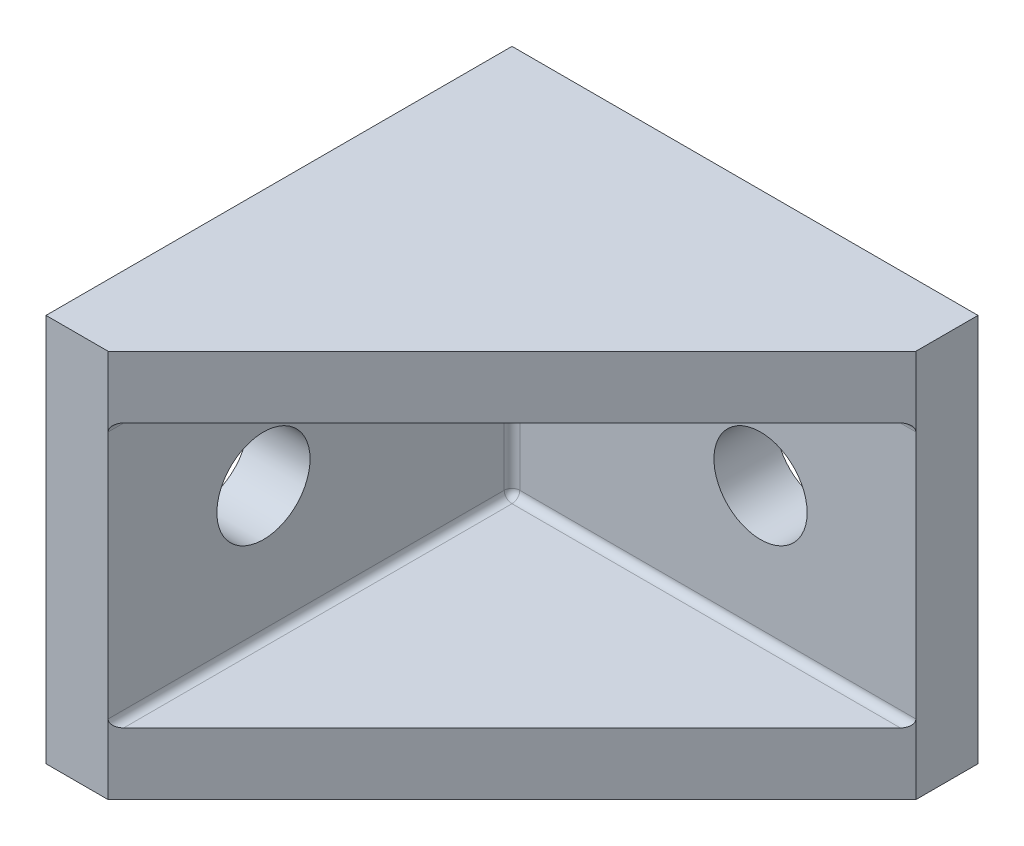
ISO-10303-21;
HEADER;
FILE_DESCRIPTION(('STEP AP214'),'2;1');
FILE_NAME('part.step','',(''),(''),'','','');
FILE_SCHEMA(('AUTOMOTIVE_DESIGN { 1 0 10303 214 1 1 1 1 }'));
ENDSEC;
DATA;
#1=APPLICATION_CONTEXT('core data for automotive mechanical design processes');
#2=APPLICATION_PROTOCOL_DEFINITION('international standard','automotive_design',2000,#1);
#3=PRODUCT_CONTEXT('',#1,'mechanical');
#4=PRODUCT('Part','Part','',(#3));
#5=PRODUCT_RELATED_PRODUCT_CATEGORY('part','',(#4));
#6=PRODUCT_DEFINITION_FORMATION('','',#4);
#7=PRODUCT_DEFINITION_CONTEXT('part definition',#1,'design');
#8=PRODUCT_DEFINITION('design','',#6,#7);
#9=PRODUCT_DEFINITION_SHAPE('','',#8);
#10=(LENGTH_UNIT() NAMED_UNIT(*) SI_UNIT(.MILLI.,.METRE.));
#11=(NAMED_UNIT(*) PLANE_ANGLE_UNIT() SI_UNIT($,.RADIAN.));
#12=(NAMED_UNIT(*) SI_UNIT($,.STERADIAN.) SOLID_ANGLE_UNIT());
#13=UNCERTAINTY_MEASURE_WITH_UNIT(LENGTH_MEASURE(1.E-05),#10,'distance_accuracy_value','');
#14=(GEOMETRIC_REPRESENTATION_CONTEXT(3) GLOBAL_UNCERTAINTY_ASSIGNED_CONTEXT((#13)) GLOBAL_UNIT_ASSIGNED_CONTEXT((#10,
#11,#12)) REPRESENTATION_CONTEXT('',''));
#15=CARTESIAN_POINT('',(0.,0.,0.));
#16=DIRECTION('',(0.,0.,1.));
#17=DIRECTION('',(1.,0.,0.));
#18=AXIS2_PLACEMENT_3D('',#15,#16,#17);
#19=CARTESIAN_POINT('',(30.,12.5,4.));
#20=DIRECTION('',(-0.707106781186547,0.,-0.707106781186547));
#21=DIRECTION('',(-0.707106781186548,0.,0.707106781186548));
#22=AXIS2_PLACEMENT_3D('',#19,#20,#21);
#23=PLANE('',#22);
#24=DIRECTION('',(0.707106781186548,0.,-0.707106781186548));
#25=VECTOR('',#24,1.);
#26=CARTESIAN_POINT('',(30.,-8.5,4.));
#27=LINE('',#26,#25);
#28=CARTESIAN_POINT('',(4.5,-8.5,29.5));
#29=VERTEX_POINT('',#28);
#30=CARTESIAN_POINT('',(29.5,-8.5,4.5));
#31=VERTEX_POINT('',#30);
#32=EDGE_CURVE('E133',#29,#31,#27,.T.);
#33=ORIENTED_EDGE('',*,*,#32,.F.);
#34=CARTESIAN_POINT('',(4.5,-8.,29.5));
#35=DIRECTION('',(-0.707106781186547,0.,-0.707106781186547));
#36=DIRECTION('',(0.707106781186548,0.,-0.707106781186548));
#37=AXIS2_PLACEMENT_3D('',#34,#35,#36);
#38=ELLIPSE('',#37,0.707106781186548,0.5);
#39=CARTESIAN_POINT('',(4.,-8.,30.));
#40=VERTEX_POINT('',#39);
#41=EDGE_CURVE('E11',#29,#40,#38,.T.);
#42=ORIENTED_EDGE('',*,*,#41,.T.);
#43=DIRECTION('',(0.,-1.,0.));
#44=VECTOR('',#43,1.);
#45=CARTESIAN_POINT('',(4.,12.5,30.));
#46=LINE('',#45,#44);
#47=CARTESIAN_POINT('',(4.,-12.5,30.));
#48=VERTEX_POINT('',#47);
#49=EDGE_CURVE('E54',#40,#48,#46,.T.);
#50=ORIENTED_EDGE('',*,*,#49,.T.);
#51=DIRECTION('',(0.707106781186547,0.,-0.707106781186547));
#52=VECTOR('',#51,1.);
#53=CARTESIAN_POINT('',(30.,-12.5,4.));
#54=LINE('',#53,#52);
#55=CARTESIAN_POINT('',(30.,-12.5,4.));
#56=VERTEX_POINT('',#55);
#57=EDGE_CURVE('E216',#48,#56,#54,.T.);
#58=ORIENTED_EDGE('',*,*,#57,.T.);
#59=DIRECTION('',(0.,-1.,0.));
#60=VECTOR('',#59,1.);
#61=CARTESIAN_POINT('',(30.,12.5,4.));
#62=LINE('',#61,#60);
#63=CARTESIAN_POINT('',(30.,-8.,4.));
#64=VERTEX_POINT('',#63);
#65=EDGE_CURVE('E82',#64,#56,#62,.T.);
#66=ORIENTED_EDGE('',*,*,#65,.F.);
#67=CARTESIAN_POINT('',(29.5,-8.,4.5));
#68=DIRECTION('',(-0.707106781186547,0.,-0.707106781186547));
#69=DIRECTION('',(0.707106781186548,0.,-0.707106781186548));
#70=AXIS2_PLACEMENT_3D('',#67,#68,#69);
#71=ELLIPSE('',#70,0.707106781186548,0.5);
#72=EDGE_CURVE('E46',#64,#31,#71,.T.);
#73=ORIENTED_EDGE('',*,*,#72,.T.);
#74=EDGE_LOOP('',(#33,#42,#50,#58,#66,#73));
#75=FACE_BOUND('',#74,.T.);
#76=ADVANCED_FACE('F37',(#75),#23,.F.);
#77=CARTESIAN_POINT('',(0.,12.5,0.));
#78=DIRECTION('',(0.,0.,1.));
#79=DIRECTION('',(1.,0.,0.));
#80=AXIS2_PLACEMENT_3D('',#77,#78,#79);
#81=PLANE('',#80);
#82=CARTESIAN_POINT('',(20.,0.,0.));
#83=DIRECTION('',(0.,0.,1.));
#84=DIRECTION('',(1.,0.,0.));
#85=AXIS2_PLACEMENT_3D('',#82,#83,#84);
#86=CIRCLE('',#85,2.99999999999999);
#87=CARTESIAN_POINT('',(23.,0.,0.));
#88=VERTEX_POINT('',#87);
#89=EDGE_CURVE('E178',#88,#88,#86,.T.);
#90=ORIENTED_EDGE('',*,*,#89,.T.);
#91=EDGE_LOOP('',(#90));
#92=FACE_BOUND('',#91,.T.);
#93=DIRECTION('',(-1.,0.,0.));
#94=VECTOR('',#93,1.);
#95=CARTESIAN_POINT('',(0.,-12.5,0.));
#96=LINE('',#95,#94);
#97=CARTESIAN_POINT('',(30.,-12.5,0.));
#98=VERTEX_POINT('',#97);
#99=CARTESIAN_POINT('',(0.,-12.5,0.));
#100=VERTEX_POINT('',#99);
#101=EDGE_CURVE('E192',#98,#100,#96,.T.);
#102=ORIENTED_EDGE('',*,*,#101,.T.);
#103=DIRECTION('',(0.,-1.,0.));
#104=VECTOR('',#103,1.);
#105=CARTESIAN_POINT('',(0.,12.5,0.));
#106=LINE('',#105,#104);
#107=CARTESIAN_POINT('',(0.,12.5,0.));
#108=VERTEX_POINT('',#107);
#109=EDGE_CURVE('E227',#108,#100,#106,.T.);
#110=ORIENTED_EDGE('',*,*,#109,.F.);
#111=DIRECTION('',(-1.,0.,0.));
#112=VECTOR('',#111,1.);
#113=CARTESIAN_POINT('',(0.,12.5,0.));
#114=LINE('',#113,#112);
#115=CARTESIAN_POINT('',(30.,12.5,0.));
#116=VERTEX_POINT('',#115);
#117=EDGE_CURVE('E197',#116,#108,#114,.T.);
#118=ORIENTED_EDGE('',*,*,#117,.F.);
#119=DIRECTION('',(0.,-1.,0.));
#120=VECTOR('',#119,1.);
#121=CARTESIAN_POINT('',(30.,12.5,0.));
#122=LINE('',#121,#120);
#123=EDGE_CURVE('E209',#116,#98,#122,.T.);
#124=ORIENTED_EDGE('',*,*,#123,.T.);
#125=EDGE_LOOP('',(#102,#110,#118,#124));
#126=FACE_BOUND('',#125,.T.);
#127=ADVANCED_FACE('F269',(#92,#126),#81,.F.);
#128=CARTESIAN_POINT('',(0.,12.5,0.));
#129=DIRECTION('',(1.,0.,0.));
#130=DIRECTION('',(0.,0.,-1.));
#131=AXIS2_PLACEMENT_3D('',#128,#129,#130);
#132=PLANE('',#131);
#133=CARTESIAN_POINT('',(0.,0.,20.));
#134=DIRECTION('',(1.,0.,0.));
#135=DIRECTION('',(0.,0.,-1.));
#136=AXIS2_PLACEMENT_3D('',#133,#134,#135);
#137=CIRCLE('',#136,2.99999999999999);
#138=CARTESIAN_POINT('',(0.,0.,17.));
#139=VERTEX_POINT('',#138);
#140=EDGE_CURVE('E146',#139,#139,#137,.T.);
#141=ORIENTED_EDGE('',*,*,#140,.T.);
#142=EDGE_LOOP('',(#141));
#143=FACE_BOUND('',#142,.T.);
#144=DIRECTION('',(0.,0.,1.));
#145=VECTOR('',#144,1.);
#146=CARTESIAN_POINT('',(0.,-12.5,0.));
#147=LINE('',#146,#145);
#148=CARTESIAN_POINT('',(0.,-12.5,30.));
#149=VERTEX_POINT('',#148);
#150=EDGE_CURVE('E212',#100,#149,#147,.T.);
#151=ORIENTED_EDGE('',*,*,#150,.T.);
#152=DIRECTION('',(0.,-1.,0.));
#153=VECTOR('',#152,1.);
#154=CARTESIAN_POINT('',(0.,12.5,30.));
#155=LINE('',#154,#153);
#156=CARTESIAN_POINT('',(0.,12.5,30.));
#157=VERTEX_POINT('',#156);
#158=EDGE_CURVE('E224',#157,#149,#155,.T.);
#159=ORIENTED_EDGE('',*,*,#158,.F.);
#160=DIRECTION('',(0.,0.,1.));
#161=VECTOR('',#160,1.);
#162=CARTESIAN_POINT('',(0.,12.5,0.));
#163=LINE('',#162,#161);
#164=EDGE_CURVE('E199',#108,#157,#163,.T.);
#165=ORIENTED_EDGE('',*,*,#164,.F.);
#166=ORIENTED_EDGE('',*,*,#109,.T.);
#167=EDGE_LOOP('',(#151,#159,#165,#166));
#168=FACE_BOUND('',#167,.T.);
#169=ADVANCED_FACE('F300',(#143,#168),#132,.F.);
#170=CARTESIAN_POINT('',(0.,12.5,30.));
#171=DIRECTION('',(0.,0.,-1.));
#172=DIRECTION('',(-1.,0.,0.));
#173=AXIS2_PLACEMENT_3D('',#170,#171,#172);
#174=PLANE('',#173);
#175=DIRECTION('',(1.,0.,0.));
#176=VECTOR('',#175,1.);
#177=CARTESIAN_POINT('',(0.,-12.5,30.));
#178=LINE('',#177,#176);
#179=EDGE_CURVE('E214',#149,#48,#178,.T.);
#180=ORIENTED_EDGE('',*,*,#179,.T.);
#181=ORIENTED_EDGE('',*,*,#49,.F.);
#182=DIRECTION('',(0.,-1.,0.));
#183=VECTOR('',#182,1.);
#184=CARTESIAN_POINT('',(4.,12.5,30.));
#185=LINE('',#184,#183);
#186=CARTESIAN_POINT('',(4.,8.,30.));
#187=VERTEX_POINT('',#186);
#188=EDGE_CURVE('E190',#187,#40,#185,.T.);
#189=ORIENTED_EDGE('',*,*,#188,.F.);
#190=CARTESIAN_POINT('',(4.,12.5,30.));
#191=VERTEX_POINT('',#190);
#192=EDGE_CURVE('E222',#191,#187,#46,.T.);
#193=ORIENTED_EDGE('',*,*,#192,.F.);
#194=DIRECTION('',(1.,0.,0.));
#195=VECTOR('',#194,1.);
#196=CARTESIAN_POINT('',(0.,12.5,30.));
#197=LINE('',#196,#195);
#198=EDGE_CURVE('E203',#157,#191,#197,.T.);
#199=ORIENTED_EDGE('',*,*,#198,.F.);
#200=ORIENTED_EDGE('',*,*,#158,.T.);
#201=EDGE_LOOP('',(#180,#181,#189,#193,#199,#200));
#202=FACE_BOUND('',#201,.T.);
#203=ADVANCED_FACE('F281',(#202),#174,.F.);
#204=ORIENTED_EDGE('',*,*,#192,.T.);
#205=CARTESIAN_POINT('',(4.5,8.,29.5));
#206=DIRECTION('',(-0.707106781186547,0.,-0.707106781186547));
#207=DIRECTION('',(-0.707106781186548,0.,0.707106781186548));
#208=AXIS2_PLACEMENT_3D('',#205,#206,#207);
#209=ELLIPSE('',#208,0.707106781186548,0.5);
#210=CARTESIAN_POINT('',(4.5,8.5,29.5));
#211=VERTEX_POINT('',#210);
#212=EDGE_CURVE('E138',#187,#211,#209,.T.);
#213=ORIENTED_EDGE('',*,*,#212,.T.);
#214=DIRECTION('',(0.707106781186548,0.,-0.707106781186548));
#215=VECTOR('',#214,1.);
#216=CARTESIAN_POINT('',(30.,8.5,4.));
#217=LINE('',#216,#215);
#218=CARTESIAN_POINT('',(29.5,8.5,4.5));
#219=VERTEX_POINT('',#218);
#220=EDGE_CURVE('E145',#211,#219,#217,.T.);
#221=ORIENTED_EDGE('',*,*,#220,.T.);
#222=CARTESIAN_POINT('',(29.5,8.,4.5));
#223=DIRECTION('',(-0.707106781186547,0.,-0.707106781186547));
#224=DIRECTION('',(-0.707106781186548,0.,0.707106781186548));
#225=AXIS2_PLACEMENT_3D('',#222,#223,#224);
#226=ELLIPSE('',#225,0.707106781186548,0.5);
#227=CARTESIAN_POINT('',(30.,8.,4.));
#228=VERTEX_POINT('',#227);
#229=EDGE_CURVE('E153',#219,#228,#226,.T.);
#230=ORIENTED_EDGE('',*,*,#229,.T.);
#231=CARTESIAN_POINT('',(30.,12.5,4.));
#232=VERTEX_POINT('',#231);
#233=EDGE_CURVE('E63',#232,#228,#62,.T.);
#234=ORIENTED_EDGE('',*,*,#233,.F.);
#235=DIRECTION('',(0.707106781186547,0.,-0.707106781186547));
#236=VECTOR('',#235,1.);
#237=CARTESIAN_POINT('',(30.,12.5,4.));
#238=LINE('',#237,#236);
#239=EDGE_CURVE('E206',#191,#232,#238,.T.);
#240=ORIENTED_EDGE('',*,*,#239,.F.);
#241=EDGE_LOOP('',(#204,#213,#221,#230,#234,#240));
#242=FACE_BOUND('',#241,.T.);
#243=ADVANCED_FACE('F253',(#242),#23,.F.);
#244=CARTESIAN_POINT('',(30.,12.5,4.));
#245=DIRECTION('',(-1.,0.,0.));
#246=DIRECTION('',(0.,0.,1.));
#247=AXIS2_PLACEMENT_3D('',#244,#245,#246);
#248=PLANE('',#247);
#249=DIRECTION('',(0.,0.,-1.));
#250=VECTOR('',#249,1.);
#251=CARTESIAN_POINT('',(30.,-12.5,4.));
#252=LINE('',#251,#250);
#253=EDGE_CURVE('E200',#56,#98,#252,.T.);
#254=ORIENTED_EDGE('',*,*,#253,.T.);
#255=ORIENTED_EDGE('',*,*,#123,.F.);
#256=DIRECTION('',(0.,0.,-1.));
#257=VECTOR('',#256,1.);
#258=CARTESIAN_POINT('',(30.,12.5,4.));
#259=LINE('',#258,#257);
#260=EDGE_CURVE('E92',#232,#116,#259,.T.);
#261=ORIENTED_EDGE('',*,*,#260,.F.);
#262=ORIENTED_EDGE('',*,*,#233,.T.);
#263=DIRECTION('',(0.,-1.,0.));
#264=VECTOR('',#263,1.);
#265=CARTESIAN_POINT('',(30.,12.5,4.));
#266=LINE('',#265,#264);
#267=EDGE_CURVE('E193',#228,#64,#266,.T.);
#268=ORIENTED_EDGE('',*,*,#267,.T.);
#269=ORIENTED_EDGE('',*,*,#65,.T.);
#270=EDGE_LOOP('',(#254,#255,#261,#262,#268,#269));
#271=FACE_BOUND('',#270,.T.);
#272=ADVANCED_FACE('F260',(#271),#248,.F.);
#273=CARTESIAN_POINT('',(0.,12.5,0.));
#274=DIRECTION('',(0.,1.,0.));
#275=DIRECTION('',(0.,0.,1.));
#276=AXIS2_PLACEMENT_3D('',#273,#274,#275);
#277=PLANE('',#276);
#278=ORIENTED_EDGE('',*,*,#117,.T.);
#279=ORIENTED_EDGE('',*,*,#164,.T.);
#280=ORIENTED_EDGE('',*,*,#198,.T.);
#281=ORIENTED_EDGE('',*,*,#239,.T.);
#282=ORIENTED_EDGE('',*,*,#260,.T.);
#283=EDGE_LOOP('',(#278,#279,#280,#281,#282));
#284=FACE_BOUND('',#283,.T.);
#285=ADVANCED_FACE('F271',(#284),#277,.T.);
#286=CARTESIAN_POINT('',(0.,-12.5,0.));
#287=DIRECTION('',(0.,1.,0.));
#288=DIRECTION('',(0.,0.,1.));
#289=AXIS2_PLACEMENT_3D('',#286,#287,#288);
#290=PLANE('',#289);
#291=ORIENTED_EDGE('',*,*,#101,.F.);
#292=ORIENTED_EDGE('',*,*,#253,.F.);
#293=ORIENTED_EDGE('',*,*,#57,.F.);
#294=ORIENTED_EDGE('',*,*,#179,.F.);
#295=ORIENTED_EDGE('',*,*,#150,.F.);
#296=EDGE_LOOP('',(#291,#292,#293,#294,#295));
#297=FACE_BOUND('',#296,.T.);
#298=ADVANCED_FACE('F266',(#297),#290,.F.);
#299=CARTESIAN_POINT('',(0.,12.5,4.));
#300=DIRECTION('',(0.,0.,1.));
#301=DIRECTION('',(1.,0.,0.));
#302=AXIS2_PLACEMENT_3D('',#299,#300,#301);
#303=PLANE('',#302);
#304=CARTESIAN_POINT('',(20.,0.,4.));
#305=DIRECTION('',(0.,0.,1.));
#306=DIRECTION('',(1.,0.,0.));
#307=AXIS2_PLACEMENT_3D('',#304,#305,#306);
#308=CIRCLE('',#307,2.99999999999999);
#309=CARTESIAN_POINT('',(23.,0.,4.));
#310=VERTEX_POINT('',#309);
#311=EDGE_CURVE('E175',#310,#310,#308,.T.);
#312=ORIENTED_EDGE('',*,*,#311,.F.);
#313=EDGE_LOOP('',(#312));
#314=FACE_BOUND('',#313,.T.);
#315=ORIENTED_EDGE('',*,*,#267,.F.);
#316=DIRECTION('',(-1.,0.,0.));
#317=VECTOR('',#316,1.);
#318=CARTESIAN_POINT('',(0.,8.,4.));
#319=LINE('',#318,#317);
#320=CARTESIAN_POINT('',(4.5,8.,4.));
#321=VERTEX_POINT('',#320);
#322=EDGE_CURVE('E235',#228,#321,#319,.T.);
#323=ORIENTED_EDGE('',*,*,#322,.T.);
#324=DIRECTION('',(0.,-1.,0.));
#325=VECTOR('',#324,1.);
#326=CARTESIAN_POINT('',(4.5,-8.5,4.));
#327=LINE('',#326,#325);
#328=CARTESIAN_POINT('',(4.5,-8.,4.));
#329=VERTEX_POINT('',#328);
#330=EDGE_CURVE('E232',#321,#329,#327,.T.);
#331=ORIENTED_EDGE('',*,*,#330,.T.);
#332=DIRECTION('',(-1.,0.,0.));
#333=VECTOR('',#332,1.);
#334=CARTESIAN_POINT('',(30.,-8.,4.));
#335=LINE('',#334,#333);
#336=EDGE_CURVE('E230',#329,#64,#335,.F.);
#337=ORIENTED_EDGE('',*,*,#336,.T.);
#338=EDGE_LOOP('',(#315,#323,#331,#337));
#339=FACE_BOUND('',#338,.T.);
#340=ADVANCED_FACE('F258',(#314,#339),#303,.T.);
#341=CARTESIAN_POINT('',(4.,12.5,0.));
#342=DIRECTION('',(1.,0.,0.));
#343=DIRECTION('',(0.,0.,-1.));
#344=AXIS2_PLACEMENT_3D('',#341,#342,#343);
#345=PLANE('',#344);
#346=CARTESIAN_POINT('',(4.,0.,20.));
#347=DIRECTION('',(1.,0.,0.));
#348=DIRECTION('',(0.,0.,-1.));
#349=AXIS2_PLACEMENT_3D('',#346,#347,#348);
#350=CIRCLE('',#349,2.99999999999999);
#351=CARTESIAN_POINT('',(4.,0.,17.));
#352=VERTEX_POINT('',#351);
#353=EDGE_CURVE('E183',#352,#352,#350,.T.);
#354=ORIENTED_EDGE('',*,*,#353,.F.);
#355=EDGE_LOOP('',(#354));
#356=FACE_BOUND('',#355,.T.);
#357=DIRECTION('',(0.,-1.,0.));
#358=VECTOR('',#357,1.);
#359=CARTESIAN_POINT('',(4.,8.5,4.5));
#360=LINE('',#359,#358);
#361=CARTESIAN_POINT('',(4.,-8.,4.5));
#362=VERTEX_POINT('',#361);
#363=CARTESIAN_POINT('',(4.,8.,4.5));
#364=VERTEX_POINT('',#363);
#365=EDGE_CURVE('E239',#362,#364,#360,.F.);
#366=ORIENTED_EDGE('',*,*,#365,.T.);
#367=DIRECTION('',(0.,0.,1.));
#368=VECTOR('',#367,1.);
#369=CARTESIAN_POINT('',(4.,8.,0.));
#370=LINE('',#369,#368);
#371=EDGE_CURVE('E241',#364,#187,#370,.T.);
#372=ORIENTED_EDGE('',*,*,#371,.T.);
#373=ORIENTED_EDGE('',*,*,#188,.T.);
#374=DIRECTION('',(0.,0.,1.));
#375=VECTOR('',#374,1.);
#376=CARTESIAN_POINT('',(4.,-8.,4.));
#377=LINE('',#376,#375);
#378=EDGE_CURVE('E237',#40,#362,#377,.F.);
#379=ORIENTED_EDGE('',*,*,#378,.T.);
#380=EDGE_LOOP('',(#366,#372,#373,#379));
#381=FACE_BOUND('',#380,.T.);
#382=ADVANCED_FACE('F284',(#356,#381),#345,.T.);
#383=CARTESIAN_POINT('',(0.,8.5,0.));
#384=DIRECTION('',(0.,1.,0.));
#385=DIRECTION('',(0.,0.,1.));
#386=AXIS2_PLACEMENT_3D('',#383,#384,#385);
#387=PLANE('',#386);
#388=DIRECTION('',(0.,0.,1.));
#389=VECTOR('',#388,1.);
#390=CARTESIAN_POINT('',(4.5,8.5,0.));
#391=LINE('',#390,#389);
#392=CARTESIAN_POINT('',(4.5,8.5,4.5));
#393=VERTEX_POINT('',#392);
#394=EDGE_CURVE('E244',#211,#393,#391,.F.);
#395=ORIENTED_EDGE('',*,*,#394,.T.);
#396=DIRECTION('',(-1.,0.,0.));
#397=VECTOR('',#396,1.);
#398=CARTESIAN_POINT('',(0.,8.5,4.5));
#399=LINE('',#398,#397);
#400=EDGE_CURVE('E157',#393,#219,#399,.F.);
#401=ORIENTED_EDGE('',*,*,#400,.T.);
#402=ORIENTED_EDGE('',*,*,#220,.F.);
#403=EDGE_LOOP('',(#395,#401,#402));
#404=FACE_BOUND('',#403,.T.);
#405=ADVANCED_FACE('F248',(#404),#387,.F.);
#406=CARTESIAN_POINT('',(0.,-8.5,0.));
#407=DIRECTION('',(0.,1.,0.));
#408=DIRECTION('',(0.,0.,1.));
#409=AXIS2_PLACEMENT_3D('',#406,#407,#408);
#410=PLANE('',#409);
#411=ORIENTED_EDGE('',*,*,#32,.T.);
#412=DIRECTION('',(-1.,0.,0.));
#413=VECTOR('',#412,1.);
#414=CARTESIAN_POINT('',(4.,-8.5,4.5));
#415=LINE('',#414,#413);
#416=CARTESIAN_POINT('',(4.5,-8.5,4.5));
#417=VERTEX_POINT('',#416);
#418=EDGE_CURVE('E142',#31,#417,#415,.T.);
#419=ORIENTED_EDGE('',*,*,#418,.T.);
#420=DIRECTION('',(0.,0.,1.));
#421=VECTOR('',#420,1.);
#422=CARTESIAN_POINT('',(4.5,-8.5,30.));
#423=LINE('',#422,#421);
#424=EDGE_CURVE('E144',#417,#29,#423,.T.);
#425=ORIENTED_EDGE('',*,*,#424,.T.);
#426=EDGE_LOOP('',(#411,#419,#425));
#427=FACE_BOUND('',#426,.T.);
#428=ADVANCED_FACE('F141',(#427),#410,.T.);
#429=CARTESIAN_POINT('',(-46.,0.,20.));
#430=DIRECTION('',(1.,0.,0.));
#431=DIRECTION('',(0.,0.,-1.));
#432=AXIS2_PLACEMENT_3D('',#429,#430,#431);
#433=CYLINDRICAL_SURFACE('',#432,2.99999999999999);
#434=ORIENTED_EDGE('',*,*,#353,.T.);
#435=EDGE_LOOP('',(#434));
#436=FACE_BOUND('',#435,.T.);
#437=ORIENTED_EDGE('',*,*,#140,.F.);
#438=EDGE_LOOP('',(#437));
#439=FACE_BOUND('',#438,.T.);
#440=ADVANCED_FACE('F293',(#436,#439),#433,.F.);
#441=CARTESIAN_POINT('',(20.,0.,-46.));
#442=DIRECTION('',(0.,0.,1.));
#443=DIRECTION('',(1.,0.,0.));
#444=AXIS2_PLACEMENT_3D('',#441,#442,#443);
#445=CYLINDRICAL_SURFACE('',#444,2.99999999999999);
#446=ORIENTED_EDGE('',*,*,#311,.T.);
#447=EDGE_LOOP('',(#446));
#448=FACE_BOUND('',#447,.T.);
#449=ORIENTED_EDGE('',*,*,#89,.F.);
#450=EDGE_LOOP('',(#449));
#451=FACE_BOUND('',#450,.T.);
#452=ADVANCED_FACE('F288',(#448,#451),#445,.F.);
#453=CARTESIAN_POINT('',(4.5,8.,0.));
#454=DIRECTION('',(0.,0.,1.));
#455=DIRECTION('',(1.,0.,0.));
#456=AXIS2_PLACEMENT_3D('',#453,#454,#455);
#457=CYLINDRICAL_SURFACE('',#456,0.5);
#458=ORIENTED_EDGE('',*,*,#212,.F.);
#459=ORIENTED_EDGE('',*,*,#371,.F.);
#460=CARTESIAN_POINT('',(4.5,8.,4.5));
#461=DIRECTION('',(0.,0.,1.));
#462=DIRECTION('',(1.,0.,0.));
#463=AXIS2_PLACEMENT_3D('',#460,#461,#462);
#464=CIRCLE('',#463,0.5);
#465=EDGE_CURVE('E41',#393,#364,#464,.T.);
#466=ORIENTED_EDGE('',*,*,#465,.F.);
#467=ORIENTED_EDGE('',*,*,#394,.F.);
#468=EDGE_LOOP('',(#458,#459,#466,#467));
#469=FACE_BOUND('',#468,.T.);
#470=ADVANCED_FACE('F39',(#469),#457,.F.);
#471=CARTESIAN_POINT('',(0.,8.,4.5));
#472=DIRECTION('',(-1.,0.,0.));
#473=DIRECTION('',(0.,0.,1.));
#474=AXIS2_PLACEMENT_3D('',#471,#472,#473);
#475=CYLINDRICAL_SURFACE('',#474,0.5);
#476=ORIENTED_EDGE('',*,*,#229,.F.);
#477=ORIENTED_EDGE('',*,*,#400,.F.);
#478=CARTESIAN_POINT('',(4.5,8.,4.5));
#479=DIRECTION('',(1.,0.,0.));
#480=DIRECTION('',(0.,0.,-1.));
#481=AXIS2_PLACEMENT_3D('',#478,#479,#480);
#482=CIRCLE('',#481,0.5);
#483=EDGE_CURVE('E169',#321,#393,#482,.T.);
#484=ORIENTED_EDGE('',*,*,#483,.F.);
#485=ORIENTED_EDGE('',*,*,#322,.F.);
#486=EDGE_LOOP('',(#476,#477,#484,#485));
#487=FACE_BOUND('',#486,.T.);
#488=ADVANCED_FACE('F256',(#487),#475,.F.);
#489=CARTESIAN_POINT('',(0.,-8.,4.5));
#490=DIRECTION('',(1.,0.,0.));
#491=DIRECTION('',(0.,0.,-1.));
#492=AXIS2_PLACEMENT_3D('',#489,#490,#491);
#493=CYLINDRICAL_SURFACE('',#492,0.5);
#494=ORIENTED_EDGE('',*,*,#72,.F.);
#495=ORIENTED_EDGE('',*,*,#336,.F.);
#496=CARTESIAN_POINT('',(4.5,-8.,4.5));
#497=DIRECTION('',(1.,0.,0.));
#498=DIRECTION('',(0.,0.,-1.));
#499=AXIS2_PLACEMENT_3D('',#496,#497,#498);
#500=CIRCLE('',#499,0.5);
#501=EDGE_CURVE('E151',#417,#329,#500,.T.);
#502=ORIENTED_EDGE('',*,*,#501,.F.);
#503=ORIENTED_EDGE('',*,*,#418,.F.);
#504=EDGE_LOOP('',(#494,#495,#502,#503));
#505=FACE_BOUND('',#504,.T.);
#506=ADVANCED_FACE('F149',(#505),#493,.F.);
#507=CARTESIAN_POINT('',(4.5,-8.,0.));
#508=DIRECTION('',(0.,0.,-1.));
#509=DIRECTION('',(-1.,0.,0.));
#510=AXIS2_PLACEMENT_3D('',#507,#508,#509);
#511=CYLINDRICAL_SURFACE('',#510,0.5);
#512=ORIENTED_EDGE('',*,*,#41,.F.);
#513=ORIENTED_EDGE('',*,*,#424,.F.);
#514=CARTESIAN_POINT('',(4.5,-8.,4.5));
#515=DIRECTION('',(0.,0.,1.));
#516=DIRECTION('',(1.,0.,0.));
#517=AXIS2_PLACEMENT_3D('',#514,#515,#516);
#518=CIRCLE('',#517,0.5);
#519=EDGE_CURVE('E167',#362,#417,#518,.T.);
#520=ORIENTED_EDGE('',*,*,#519,.F.);
#521=ORIENTED_EDGE('',*,*,#378,.F.);
#522=EDGE_LOOP('',(#512,#513,#520,#521));
#523=FACE_BOUND('',#522,.T.);
#524=ADVANCED_FACE('F327',(#523),#511,.F.);
#525=CARTESIAN_POINT('',(4.5,8.,4.5));
#526=DIRECTION('',(0.,0.,1.));
#527=DIRECTION('',(1.,0.,0.));
#528=AXIS2_PLACEMENT_3D('',#525,#526,#527);
#529=SPHERICAL_SURFACE('',#528,0.5);
#530=ORIENTED_EDGE('',*,*,#483,.T.);
#531=ORIENTED_EDGE('',*,*,#465,.T.);
#532=CARTESIAN_POINT('',(4.5,8.,4.5));
#533=DIRECTION('',(0.,-1.,0.));
#534=DIRECTION('',(0.,0.,-1.));
#535=AXIS2_PLACEMENT_3D('',#532,#533,#534);
#536=CIRCLE('',#535,0.5);
#537=EDGE_CURVE('E164',#321,#364,#536,.F.);
#538=ORIENTED_EDGE('',*,*,#537,.F.);
#539=EDGE_LOOP('',(#530,#531,#538));
#540=FACE_BOUND('',#539,.T.);
#541=ADVANCED_FACE('F323',(#540),#529,.F.);
#542=CARTESIAN_POINT('',(4.5,-8.,4.5));
#543=DIRECTION('',(0.,0.,1.));
#544=DIRECTION('',(1.,0.,0.));
#545=AXIS2_PLACEMENT_3D('',#542,#543,#544);
#546=SPHERICAL_SURFACE('',#545,0.5);
#547=ORIENTED_EDGE('',*,*,#519,.T.);
#548=ORIENTED_EDGE('',*,*,#501,.T.);
#549=CARTESIAN_POINT('',(4.5,-8.,4.5));
#550=DIRECTION('',(0.,1.,0.));
#551=DIRECTION('',(0.,0.,1.));
#552=AXIS2_PLACEMENT_3D('',#549,#550,#551);
#553=CIRCLE('',#552,0.5);
#554=EDGE_CURVE('E162',#362,#329,#553,.F.);
#555=ORIENTED_EDGE('',*,*,#554,.F.);
#556=EDGE_LOOP('',(#547,#548,#555));
#557=FACE_BOUND('',#556,.T.);
#558=ADVANCED_FACE('F319',(#557),#546,.F.);
#559=CARTESIAN_POINT('',(4.5,12.5,4.5));
#560=DIRECTION('',(0.,1.,0.));
#561=DIRECTION('',(0.,0.,1.));
#562=AXIS2_PLACEMENT_3D('',#559,#560,#561);
#563=CYLINDRICAL_SURFACE('',#562,0.5);
#564=ORIENTED_EDGE('',*,*,#537,.T.);
#565=ORIENTED_EDGE('',*,*,#365,.F.);
#566=ORIENTED_EDGE('',*,*,#554,.T.);
#567=ORIENTED_EDGE('',*,*,#330,.F.);
#568=EDGE_LOOP('',(#564,#565,#566,#567));
#569=FACE_BOUND('',#568,.T.);
#570=ADVANCED_FACE('F316',(#569),#563,.F.);
#571=CLOSED_SHELL('',(#76,#127,#169,#203,#243,#272,#285,#298,#340,#382,#405,#428,#440,#452,#470,
#488,#506,#524,#541,#558,#570));
#572=MANIFOLD_SOLID_BREP('B2',#571);
#573=ADVANCED_BREP_SHAPE_REPRESENTATION('',(#18,#572),#14);
#574=SHAPE_DEFINITION_REPRESENTATION(#9,#573);
ENDSEC;
END-ISO-10303-21;
